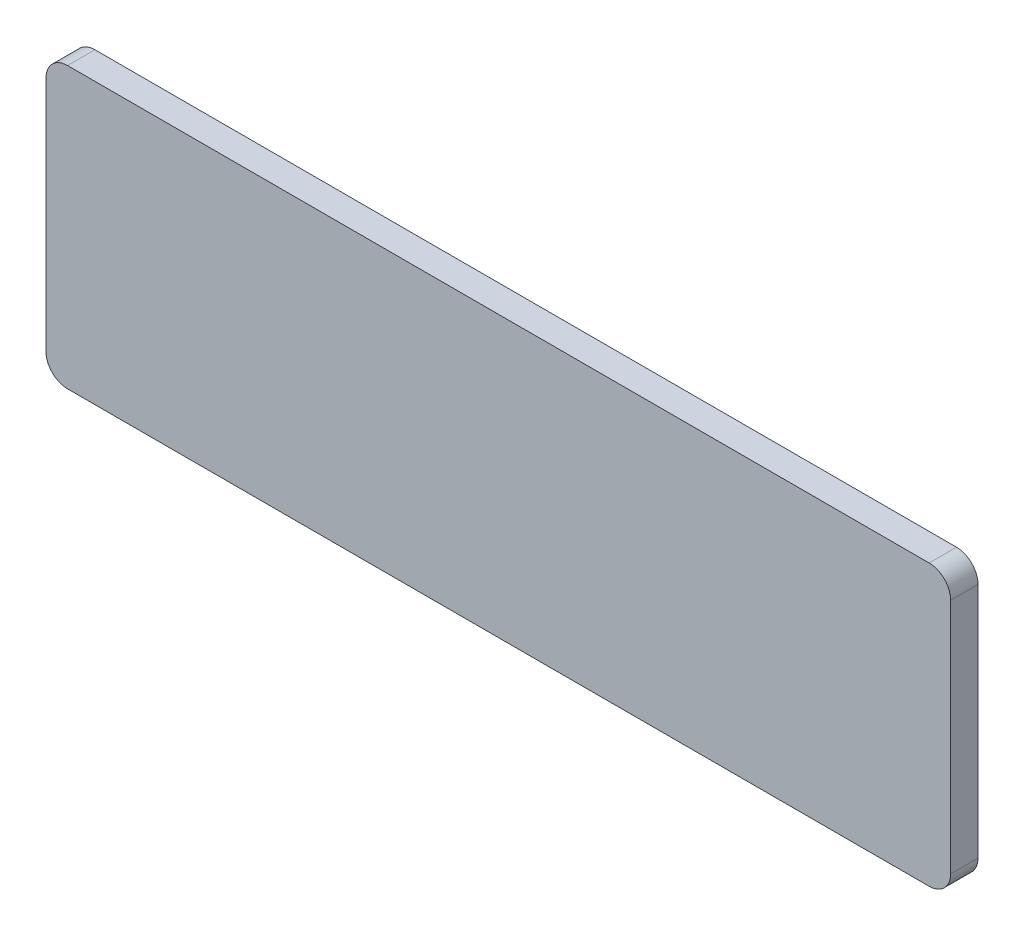
ISO-10303-21;
HEADER;
FILE_DESCRIPTION(('STEP AP214'),'2;1');
FILE_NAME('part.step','',(''),(''),'','','');
FILE_SCHEMA(('AUTOMOTIVE_DESIGN { 1 0 10303 214 1 1 1 1 }'));
ENDSEC;
DATA;
#1=APPLICATION_CONTEXT('core data for automotive mechanical design processes');
#2=APPLICATION_PROTOCOL_DEFINITION('international standard','automotive_design',2000,#1);
#3=PRODUCT_CONTEXT('',#1,'mechanical');
#4=PRODUCT('Part','Part','',(#3));
#5=PRODUCT_RELATED_PRODUCT_CATEGORY('part','',(#4));
#6=PRODUCT_DEFINITION_FORMATION('','',#4);
#7=PRODUCT_DEFINITION_CONTEXT('part definition',#1,'design');
#8=PRODUCT_DEFINITION('design','',#6,#7);
#9=PRODUCT_DEFINITION_SHAPE('','',#8);
#10=(LENGTH_UNIT() NAMED_UNIT(*) SI_UNIT(.MILLI.,.METRE.));
#11=(NAMED_UNIT(*) PLANE_ANGLE_UNIT() SI_UNIT($,.RADIAN.));
#12=(NAMED_UNIT(*) SI_UNIT($,.STERADIAN.) SOLID_ANGLE_UNIT());
#13=UNCERTAINTY_MEASURE_WITH_UNIT(LENGTH_MEASURE(1.E-05),#10,'distance_accuracy_value','');
#14=(GEOMETRIC_REPRESENTATION_CONTEXT(3) GLOBAL_UNCERTAINTY_ASSIGNED_CONTEXT((#13)) GLOBAL_UNIT_ASSIGNED_CONTEXT((#10,
#11,#12)) REPRESENTATION_CONTEXT('',''));
#15=CARTESIAN_POINT('',(0.,0.,0.));
#16=DIRECTION('',(0.,0.,1.));
#17=DIRECTION('',(1.,0.,0.));
#18=AXIS2_PLACEMENT_3D('',#15,#16,#17);
#19=CARTESIAN_POINT('',(-105.,32.5,3.175));
#20=DIRECTION('',(1.,0.,0.));
#21=DIRECTION('',(0.,0.,-1.));
#22=AXIS2_PLACEMENT_3D('',#19,#20,#21);
#23=PLANE('',#22);
#24=DIRECTION('',(0.,-1.,0.));
#25=VECTOR('',#24,1.);
#26=CARTESIAN_POINT('',(-105.,32.5,-3.175));
#27=LINE('',#26,#25);
#28=CARTESIAN_POINT('',(-105.,27.5,-3.175));
#29=VERTEX_POINT('',#28);
#30=CARTESIAN_POINT('',(-105.,-27.5,-3.175));
#31=VERTEX_POINT('',#30);
#32=EDGE_CURVE('E138',#29,#31,#27,.T.);
#33=ORIENTED_EDGE('',*,*,#32,.T.);
#34=DIRECTION('',(0.,0.,-1.));
#35=VECTOR('',#34,1.);
#36=CARTESIAN_POINT('',(-105.,-27.5,3.175));
#37=LINE('',#36,#35);
#38=CARTESIAN_POINT('',(-105.,-27.5,3.175));
#39=VERTEX_POINT('',#38);
#40=EDGE_CURVE('E112',#31,#39,#37,.F.);
#41=ORIENTED_EDGE('',*,*,#40,.T.);
#42=DIRECTION('',(0.,-1.,0.));
#43=VECTOR('',#42,1.);
#44=CARTESIAN_POINT('',(-105.,32.5,3.175));
#45=LINE('',#44,#43);
#46=CARTESIAN_POINT('',(-105.,27.5,3.175));
#47=VERTEX_POINT('',#46);
#48=EDGE_CURVE('E150',#47,#39,#45,.T.);
#49=ORIENTED_EDGE('',*,*,#48,.F.);
#50=DIRECTION('',(0.,0.,-1.));
#51=VECTOR('',#50,1.);
#52=CARTESIAN_POINT('',(-105.,27.5,3.175));
#53=LINE('',#52,#51);
#54=EDGE_CURVE('E118',#47,#29,#53,.T.);
#55=ORIENTED_EDGE('',*,*,#54,.T.);
#56=EDGE_LOOP('',(#33,#41,#49,#55));
#57=FACE_BOUND('',#56,.T.);
#58=ADVANCED_FACE('F39',(#57),#23,.F.);
#59=CARTESIAN_POINT('',(-105.,-32.5,3.175));
#60=DIRECTION('',(0.,1.,0.));
#61=DIRECTION('',(-1.,0.,0.));
#62=AXIS2_PLACEMENT_3D('',#59,#60,#61);
#63=PLANE('',#62);
#64=DIRECTION('',(1.,0.,0.));
#65=VECTOR('',#64,1.);
#66=CARTESIAN_POINT('',(-105.,-32.5,3.175));
#67=LINE('',#66,#65);
#68=CARTESIAN_POINT('',(-100.,-32.5,3.175));
#69=VERTEX_POINT('',#68);
#70=CARTESIAN_POINT('',(100.,-32.5,3.175));
#71=VERTEX_POINT('',#70);
#72=EDGE_CURVE('E128',#69,#71,#67,.T.);
#73=ORIENTED_EDGE('',*,*,#72,.F.);
#74=DIRECTION('',(0.,0.,-1.));
#75=VECTOR('',#74,1.);
#76=CARTESIAN_POINT('',(-100.,-32.5,3.175));
#77=LINE('',#76,#75);
#78=CARTESIAN_POINT('',(-100.,-32.5,-3.175));
#79=VERTEX_POINT('',#78);
#80=EDGE_CURVE('E111',#69,#79,#77,.T.);
#81=ORIENTED_EDGE('',*,*,#80,.T.);
#82=DIRECTION('',(1.,0.,0.));
#83=VECTOR('',#82,1.);
#84=CARTESIAN_POINT('',(-105.,-32.5,-3.175));
#85=LINE('',#84,#83);
#86=CARTESIAN_POINT('',(100.,-32.5,-3.175));
#87=VERTEX_POINT('',#86);
#88=EDGE_CURVE('E125',#79,#87,#85,.T.);
#89=ORIENTED_EDGE('',*,*,#88,.T.);
#90=DIRECTION('',(0.,0.,-1.));
#91=VECTOR('',#90,1.);
#92=CARTESIAN_POINT('',(100.,-32.5,3.175));
#93=LINE('',#92,#91);
#94=EDGE_CURVE('E131',#87,#71,#93,.F.);
#95=ORIENTED_EDGE('',*,*,#94,.T.);
#96=EDGE_LOOP('',(#73,#81,#89,#95));
#97=FACE_BOUND('',#96,.T.);
#98=ADVANCED_FACE('F124',(#97),#63,.F.);
#99=CARTESIAN_POINT('',(105.,32.5,3.175));
#100=DIRECTION('',(-1.,0.,0.));
#101=DIRECTION('',(0.,0.,1.));
#102=AXIS2_PLACEMENT_3D('',#99,#100,#101);
#103=PLANE('',#102);
#104=DIRECTION('',(0.,1.,0.));
#105=VECTOR('',#104,1.);
#106=CARTESIAN_POINT('',(105.,32.5,3.175));
#107=LINE('',#106,#105);
#108=CARTESIAN_POINT('',(105.,-27.5,3.175));
#109=VERTEX_POINT('',#108);
#110=CARTESIAN_POINT('',(105.,27.5,3.175));
#111=VERTEX_POINT('',#110);
#112=EDGE_CURVE('E186',#109,#111,#107,.T.);
#113=ORIENTED_EDGE('',*,*,#112,.F.);
#114=DIRECTION('',(0.,0.,-1.));
#115=VECTOR('',#114,1.);
#116=CARTESIAN_POINT('',(105.,-27.5,3.175));
#117=LINE('',#116,#115);
#118=CARTESIAN_POINT('',(105.,-27.5,-3.175));
#119=VERTEX_POINT('',#118);
#120=EDGE_CURVE('E11',#109,#119,#117,.T.);
#121=ORIENTED_EDGE('',*,*,#120,.T.);
#122=DIRECTION('',(0.,1.,0.));
#123=VECTOR('',#122,1.);
#124=CARTESIAN_POINT('',(105.,32.5,-3.175));
#125=LINE('',#124,#123);
#126=CARTESIAN_POINT('',(105.,27.5,-3.175));
#127=VERTEX_POINT('',#126);
#128=EDGE_CURVE('E137',#119,#127,#125,.T.);
#129=ORIENTED_EDGE('',*,*,#128,.T.);
#130=DIRECTION('',(0.,0.,-1.));
#131=VECTOR('',#130,1.);
#132=CARTESIAN_POINT('',(105.,27.5,3.175));
#133=LINE('',#132,#131);
#134=EDGE_CURVE('E48',#127,#111,#133,.F.);
#135=ORIENTED_EDGE('',*,*,#134,.T.);
#136=EDGE_LOOP('',(#113,#121,#129,#135));
#137=FACE_BOUND('',#136,.T.);
#138=ADVANCED_FACE('F185',(#137),#103,.F.);
#139=CARTESIAN_POINT('',(-105.,32.5,3.175));
#140=DIRECTION('',(0.,-1.,0.));
#141=DIRECTION('',(0.,0.,-1.));
#142=AXIS2_PLACEMENT_3D('',#139,#140,#141);
#143=PLANE('',#142);
#144=DIRECTION('',(-1.,0.,0.));
#145=VECTOR('',#144,1.);
#146=CARTESIAN_POINT('',(-105.,32.5,-3.175));
#147=LINE('',#146,#145);
#148=CARTESIAN_POINT('',(100.,32.5,-3.175));
#149=VERTEX_POINT('',#148);
#150=CARTESIAN_POINT('',(-100.,32.5,-3.175));
#151=VERTEX_POINT('',#150);
#152=EDGE_CURVE('E143',#149,#151,#147,.T.);
#153=ORIENTED_EDGE('',*,*,#152,.T.);
#154=DIRECTION('',(0.,0.,-1.));
#155=VECTOR('',#154,1.);
#156=CARTESIAN_POINT('',(-100.,32.5,3.175));
#157=LINE('',#156,#155);
#158=CARTESIAN_POINT('',(-100.,32.5,3.175));
#159=VERTEX_POINT('',#158);
#160=EDGE_CURVE('E55',#151,#159,#157,.F.);
#161=ORIENTED_EDGE('',*,*,#160,.T.);
#162=DIRECTION('',(-1.,0.,0.));
#163=VECTOR('',#162,1.);
#164=CARTESIAN_POINT('',(-105.,32.5,3.175));
#165=LINE('',#164,#163);
#166=CARTESIAN_POINT('',(100.,32.5,3.175));
#167=VERTEX_POINT('',#166);
#168=EDGE_CURVE('E152',#167,#159,#165,.T.);
#169=ORIENTED_EDGE('',*,*,#168,.F.);
#170=DIRECTION('',(0.,0.,-1.));
#171=VECTOR('',#170,1.);
#172=CARTESIAN_POINT('',(100.,32.5,3.175));
#173=LINE('',#172,#171);
#174=EDGE_CURVE('E176',#167,#149,#173,.T.);
#175=ORIENTED_EDGE('',*,*,#174,.T.);
#176=EDGE_LOOP('',(#153,#161,#169,#175));
#177=FACE_BOUND('',#176,.T.);
#178=ADVANCED_FACE('F196',(#177),#143,.F.);
#179=CARTESIAN_POINT('',(0.,0.,3.175));
#180=DIRECTION('',(0.,0.,1.));
#181=DIRECTION('',(1.,0.,0.));
#182=AXIS2_PLACEMENT_3D('',#179,#180,#181);
#183=PLANE('',#182);
#184=ORIENTED_EDGE('',*,*,#48,.T.);
#185=CARTESIAN_POINT('',(-100.,-27.5,3.175));
#186=DIRECTION('',(0.,0.,1.));
#187=DIRECTION('',(1.,0.,0.));
#188=AXIS2_PLACEMENT_3D('',#185,#186,#187);
#189=CIRCLE('',#188,5.);
#190=EDGE_CURVE('E173',#39,#69,#189,.T.);
#191=ORIENTED_EDGE('',*,*,#190,.T.);
#192=ORIENTED_EDGE('',*,*,#72,.T.);
#193=CARTESIAN_POINT('',(100.,-27.5,3.175));
#194=DIRECTION('',(0.,0.,1.));
#195=DIRECTION('',(1.,0.,0.));
#196=AXIS2_PLACEMENT_3D('',#193,#194,#195);
#197=CIRCLE('',#196,5.);
#198=EDGE_CURVE('E167',#71,#109,#197,.T.);
#199=ORIENTED_EDGE('',*,*,#198,.T.);
#200=ORIENTED_EDGE('',*,*,#112,.T.);
#201=CARTESIAN_POINT('',(100.,27.5,3.175));
#202=DIRECTION('',(0.,0.,1.));
#203=DIRECTION('',(1.,0.,0.));
#204=AXIS2_PLACEMENT_3D('',#201,#202,#203);
#205=CIRCLE('',#204,5.);
#206=EDGE_CURVE('E62',#111,#167,#205,.T.);
#207=ORIENTED_EDGE('',*,*,#206,.T.);
#208=ORIENTED_EDGE('',*,*,#168,.T.);
#209=CARTESIAN_POINT('',(-100.,27.5,3.175));
#210=DIRECTION('',(0.,0.,1.));
#211=DIRECTION('',(1.,0.,0.));
#212=AXIS2_PLACEMENT_3D('',#209,#210,#211);
#213=CIRCLE('',#212,5.);
#214=EDGE_CURVE('E170',#159,#47,#213,.T.);
#215=ORIENTED_EDGE('',*,*,#214,.T.);
#216=EDGE_LOOP('',(#184,#191,#192,#199,#200,#207,#208,#215));
#217=FACE_BOUND('',#216,.T.);
#218=ADVANCED_FACE('F190',(#217),#183,.T.);
#219=CARTESIAN_POINT('',(0.,0.,-3.175));
#220=DIRECTION('',(0.,0.,1.));
#221=DIRECTION('',(1.,0.,0.));
#222=AXIS2_PLACEMENT_3D('',#219,#220,#221);
#223=PLANE('',#222);
#224=ORIENTED_EDGE('',*,*,#88,.F.);
#225=CARTESIAN_POINT('',(-100.,-27.5,-3.175));
#226=DIRECTION('',(0.,0.,1.));
#227=DIRECTION('',(1.,0.,0.));
#228=AXIS2_PLACEMENT_3D('',#225,#226,#227);
#229=CIRCLE('',#228,5.);
#230=EDGE_CURVE('E107',#79,#31,#229,.F.);
#231=ORIENTED_EDGE('',*,*,#230,.T.);
#232=ORIENTED_EDGE('',*,*,#32,.F.);
#233=CARTESIAN_POINT('',(-100.,27.5,-3.175));
#234=DIRECTION('',(0.,0.,1.));
#235=DIRECTION('',(1.,0.,0.));
#236=AXIS2_PLACEMENT_3D('',#233,#234,#235);
#237=CIRCLE('',#236,5.);
#238=EDGE_CURVE('E119',#29,#151,#237,.F.);
#239=ORIENTED_EDGE('',*,*,#238,.T.);
#240=ORIENTED_EDGE('',*,*,#152,.F.);
#241=CARTESIAN_POINT('',(100.,27.5,-3.175));
#242=DIRECTION('',(0.,0.,1.));
#243=DIRECTION('',(1.,0.,0.));
#244=AXIS2_PLACEMENT_3D('',#241,#242,#243);
#245=CIRCLE('',#244,5.);
#246=EDGE_CURVE('E130',#149,#127,#245,.F.);
#247=ORIENTED_EDGE('',*,*,#246,.T.);
#248=ORIENTED_EDGE('',*,*,#128,.F.);
#249=CARTESIAN_POINT('',(100.,-27.5,-3.175));
#250=DIRECTION('',(0.,0.,1.));
#251=DIRECTION('',(1.,0.,0.));
#252=AXIS2_PLACEMENT_3D('',#249,#250,#251);
#253=CIRCLE('',#252,5.);
#254=EDGE_CURVE('E135',#119,#87,#253,.F.);
#255=ORIENTED_EDGE('',*,*,#254,.T.);
#256=EDGE_LOOP('',(#224,#231,#232,#239,#240,#247,#248,#255));
#257=FACE_BOUND('',#256,.T.);
#258=ADVANCED_FACE('F133',(#257),#223,.F.);
#259=CARTESIAN_POINT('',(-100.,-27.5,3.175));
#260=DIRECTION('',(0.,0.,-1.));
#261=DIRECTION('',(-1.,0.,0.));
#262=AXIS2_PLACEMENT_3D('',#259,#260,#261);
#263=CYLINDRICAL_SURFACE('',#262,5.);
#264=ORIENTED_EDGE('',*,*,#190,.F.);
#265=ORIENTED_EDGE('',*,*,#40,.F.);
#266=ORIENTED_EDGE('',*,*,#230,.F.);
#267=ORIENTED_EDGE('',*,*,#80,.F.);
#268=EDGE_LOOP('',(#264,#265,#266,#267));
#269=FACE_BOUND('',#268,.T.);
#270=ADVANCED_FACE('F110',(#269),#263,.T.);
#271=CARTESIAN_POINT('',(-100.,27.5,3.175));
#272=DIRECTION('',(0.,0.,-1.));
#273=DIRECTION('',(-1.,0.,0.));
#274=AXIS2_PLACEMENT_3D('',#271,#272,#273);
#275=CYLINDRICAL_SURFACE('',#274,5.);
#276=ORIENTED_EDGE('',*,*,#214,.F.);
#277=ORIENTED_EDGE('',*,*,#160,.F.);
#278=ORIENTED_EDGE('',*,*,#238,.F.);
#279=ORIENTED_EDGE('',*,*,#54,.F.);
#280=EDGE_LOOP('',(#276,#277,#278,#279));
#281=FACE_BOUND('',#280,.T.);
#282=ADVANCED_FACE('F200',(#281),#275,.T.);
#283=CARTESIAN_POINT('',(100.,-27.5,3.175));
#284=DIRECTION('',(0.,0.,-1.));
#285=DIRECTION('',(-1.,0.,0.));
#286=AXIS2_PLACEMENT_3D('',#283,#284,#285);
#287=CYLINDRICAL_SURFACE('',#286,5.);
#288=ORIENTED_EDGE('',*,*,#198,.F.);
#289=ORIENTED_EDGE('',*,*,#94,.F.);
#290=ORIENTED_EDGE('',*,*,#254,.F.);
#291=ORIENTED_EDGE('',*,*,#120,.F.);
#292=EDGE_LOOP('',(#288,#289,#290,#291));
#293=FACE_BOUND('',#292,.T.);
#294=ADVANCED_FACE('F209',(#293),#287,.T.);
#295=CARTESIAN_POINT('',(100.,27.5,3.175));
#296=DIRECTION('',(0.,0.,-1.));
#297=DIRECTION('',(-1.,0.,0.));
#298=AXIS2_PLACEMENT_3D('',#295,#296,#297);
#299=CYLINDRICAL_SURFACE('',#298,5.);
#300=ORIENTED_EDGE('',*,*,#206,.F.);
#301=ORIENTED_EDGE('',*,*,#134,.F.);
#302=ORIENTED_EDGE('',*,*,#246,.F.);
#303=ORIENTED_EDGE('',*,*,#174,.F.);
#304=EDGE_LOOP('',(#300,#301,#302,#303));
#305=FACE_BOUND('',#304,.T.);
#306=ADVANCED_FACE('F41',(#305),#299,.T.);
#307=CLOSED_SHELL('',(#58,#98,#138,#178,#218,#258,#270,#282,#294,#306));
#308=MANIFOLD_SOLID_BREP('B2',#307);
#309=ADVANCED_BREP_SHAPE_REPRESENTATION('',(#18,#308),#14);
#310=SHAPE_DEFINITION_REPRESENTATION(#9,#309);
ENDSEC;
END-ISO-10303-21;
